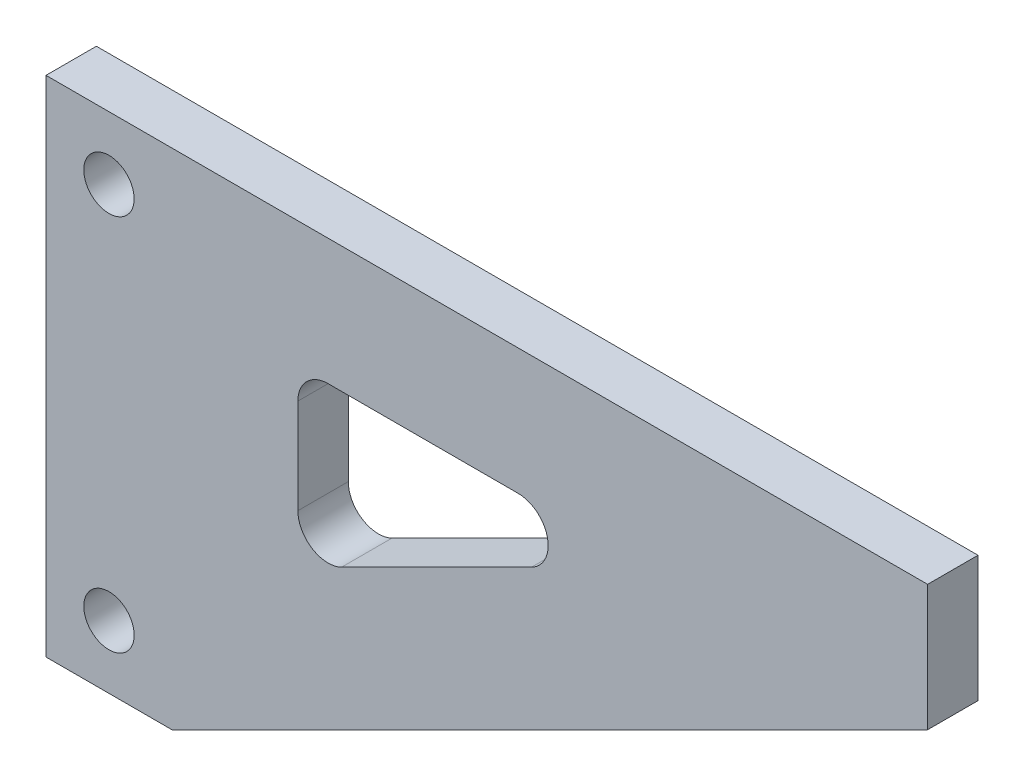
ISO-10303-21;
HEADER;
FILE_DESCRIPTION(('STEP AP214'),'2;1');
FILE_NAME('part.step','',(''),(''),'','','');
FILE_SCHEMA(('AUTOMOTIVE_DESIGN { 1 0 10303 214 1 1 1 1 }'));
ENDSEC;
DATA;
#1=APPLICATION_CONTEXT('core data for automotive mechanical design processes');
#2=APPLICATION_PROTOCOL_DEFINITION('international standard','automotive_design',2000,#1);
#3=PRODUCT_CONTEXT('',#1,'mechanical');
#4=PRODUCT('Part','Part','',(#3));
#5=PRODUCT_RELATED_PRODUCT_CATEGORY('part','',(#4));
#6=PRODUCT_DEFINITION_FORMATION('','',#4);
#7=PRODUCT_DEFINITION_CONTEXT('part definition',#1,'design');
#8=PRODUCT_DEFINITION('design','',#6,#7);
#9=PRODUCT_DEFINITION_SHAPE('','',#8);
#10=(LENGTH_UNIT() NAMED_UNIT(*) SI_UNIT(.MILLI.,.METRE.));
#11=(NAMED_UNIT(*) PLANE_ANGLE_UNIT() SI_UNIT($,.RADIAN.));
#12=(NAMED_UNIT(*) SI_UNIT($,.STERADIAN.) SOLID_ANGLE_UNIT());
#13=UNCERTAINTY_MEASURE_WITH_UNIT(LENGTH_MEASURE(1.E-05),#10,'distance_accuracy_value','');
#14=(GEOMETRIC_REPRESENTATION_CONTEXT(3) GLOBAL_UNCERTAINTY_ASSIGNED_CONTEXT((#13)) GLOBAL_UNIT_ASSIGNED_CONTEXT((#10,
#11,#12)) REPRESENTATION_CONTEXT('',''));
#15=CARTESIAN_POINT('',(0.,0.,0.));
#16=DIRECTION('',(0.,0.,1.));
#17=DIRECTION('',(1.,0.,0.));
#18=AXIS2_PLACEMENT_3D('',#15,#16,#17);
#19=CARTESIAN_POINT('',(0.,100.,10.));
#20=DIRECTION('',(0.,0.,-1.));
#21=DIRECTION('',(-1.,0.,0.));
#22=AXIS2_PLACEMENT_3D('',#19,#20,#21);
#23=PLANE('',#22);
#24=CARTESIAN_POINT('',(12.5,87.5,10.));
#25=DIRECTION('',(0.,0.,1.));
#26=DIRECTION('',(1.,0.,0.));
#27=AXIS2_PLACEMENT_3D('',#24,#25,#26);
#28=CIRCLE('',#27,5.);
#29=CARTESIAN_POINT('',(17.5,87.5,10.));
#30=VERTEX_POINT('',#29);
#31=EDGE_CURVE('E178',#30,#30,#28,.T.);
#32=ORIENTED_EDGE('',*,*,#31,.F.);
#33=EDGE_LOOP('',(#32));
#34=FACE_BOUND('',#33,.T.);
#35=DIRECTION('',(0.,1.,0.));
#36=VECTOR('',#35,1.);
#37=CARTESIAN_POINT('',(0.,0.,10.));
#38=LINE('',#37,#36);
#39=CARTESIAN_POINT('',(0.,0.,10.));
#40=VERTEX_POINT('',#39);
#41=CARTESIAN_POINT('',(0.,100.,10.));
#42=VERTEX_POINT('',#41);
#43=EDGE_CURVE('E202',#40,#42,#38,.T.);
#44=ORIENTED_EDGE('',*,*,#43,.F.);
#45=DIRECTION('',(1.,0.,0.));
#46=VECTOR('',#45,1.);
#47=CARTESIAN_POINT('',(0.,0.,10.));
#48=LINE('',#47,#46);
#49=CARTESIAN_POINT('',(25.,0.,10.));
#50=VERTEX_POINT('',#49);
#51=EDGE_CURVE('E214',#40,#50,#48,.T.);
#52=ORIENTED_EDGE('',*,*,#51,.T.);
#53=DIRECTION('',(-0.894427190999916,-0.447213595499958,0.));
#54=VECTOR('',#53,1.);
#55=CARTESIAN_POINT('',(175.,75.,10.));
#56=LINE('',#55,#54);
#57=CARTESIAN_POINT('',(175.,75.,10.));
#58=VERTEX_POINT('',#57);
#59=EDGE_CURVE('E211',#58,#50,#56,.T.);
#60=ORIENTED_EDGE('',*,*,#59,.F.);
#61=DIRECTION('',(0.,-1.,0.));
#62=VECTOR('',#61,1.);
#63=CARTESIAN_POINT('',(175.,100.,10.));
#64=LINE('',#63,#62);
#65=CARTESIAN_POINT('',(175.,100.,10.));
#66=VERTEX_POINT('',#65);
#67=EDGE_CURVE('E208',#66,#58,#64,.T.);
#68=ORIENTED_EDGE('',*,*,#67,.F.);
#69=DIRECTION('',(1.,0.,0.));
#70=VECTOR('',#69,1.);
#71=CARTESIAN_POINT('',(0.,100.,10.));
#72=LINE('',#71,#70);
#73=EDGE_CURVE('E205',#42,#66,#72,.T.);
#74=ORIENTED_EDGE('',*,*,#73,.F.);
#75=EDGE_LOOP('',(#44,#52,#60,#68,#74));
#76=FACE_BOUND('',#75,.T.);
#77=CARTESIAN_POINT('',(12.5,12.5,10.));
#78=DIRECTION('',(0.,0.,1.));
#79=DIRECTION('',(1.,0.,0.));
#80=AXIS2_PLACEMENT_3D('',#77,#78,#79);
#81=CIRCLE('',#80,5.);
#82=CARTESIAN_POINT('',(17.5,12.5,10.));
#83=VERTEX_POINT('',#82);
#84=EDGE_CURVE('E184',#83,#83,#81,.T.);
#85=ORIENTED_EDGE('',*,*,#84,.F.);
#86=EDGE_LOOP('',(#85));
#87=FACE_BOUND('',#86,.T.);
#88=CARTESIAN_POINT('',(93.6818926975065,69.,10.));
#89=DIRECTION('',(0.,0.,1.));
#90=DIRECTION('',(1.,0.,0.));
#91=AXIS2_PLACEMENT_3D('',#88,#89,#90);
#92=CIRCLE('',#91,6.00000000000001);
#93=CARTESIAN_POINT('',(96.3651742705062,63.6334368540005,10.));
#94=VERTEX_POINT('',#93);
#95=CARTESIAN_POINT('',(93.6818926975065,75.,10.));
#96=VERTEX_POINT('',#95);
#97=EDGE_CURVE('E127',#94,#96,#92,.T.);
#98=ORIENTED_EDGE('',*,*,#97,.F.);
#99=DIRECTION('',(-0.894427190999916,-0.447213595499958,0.));
#100=VECTOR('',#99,1.);
#101=CARTESIAN_POINT('',(96.3651742705062,63.6334368540005,10.));
#102=LINE('',#101,#100);
#103=CARTESIAN_POINT('',(58.6832815729997,44.7924905052472,10.));
#104=VERTEX_POINT('',#103);
#105=EDGE_CURVE('E165',#94,#104,#102,.T.);
#106=ORIENTED_EDGE('',*,*,#105,.T.);
#107=CARTESIAN_POINT('',(56.,50.1590536512467,10.));
#108=DIRECTION('',(0.,0.,1.));
#109=DIRECTION('',(1.,0.,0.));
#110=AXIS2_PLACEMENT_3D('',#107,#108,#109);
#111=CIRCLE('',#110,6.);
#112=CARTESIAN_POINT('',(50.,50.1590536512467,10.));
#113=VERTEX_POINT('',#112);
#114=EDGE_CURVE('E163',#113,#104,#111,.T.);
#115=ORIENTED_EDGE('',*,*,#114,.F.);
#116=DIRECTION('',(0.,1.,0.));
#117=VECTOR('',#116,1.);
#118=CARTESIAN_POINT('',(50.,50.1590536512467,10.));
#119=LINE('',#118,#117);
#120=CARTESIAN_POINT('',(50.,69.,10.));
#121=VERTEX_POINT('',#120);
#122=EDGE_CURVE('E160',#113,#121,#119,.T.);
#123=ORIENTED_EDGE('',*,*,#122,.T.);
#124=CARTESIAN_POINT('',(56.,69.,10.));
#125=DIRECTION('',(0.,0.,1.));
#126=DIRECTION('',(1.,0.,0.));
#127=AXIS2_PLACEMENT_3D('',#124,#125,#126);
#128=CIRCLE('',#127,6.);
#129=CARTESIAN_POINT('',(56.,75.,10.));
#130=VERTEX_POINT('',#129);
#131=EDGE_CURVE('E158',#130,#121,#128,.T.);
#132=ORIENTED_EDGE('',*,*,#131,.F.);
#133=DIRECTION('',(1.,0.,0.));
#134=VECTOR('',#133,1.);
#135=CARTESIAN_POINT('',(56.,75.,10.));
#136=LINE('',#135,#134);
#137=EDGE_CURVE('E156',#130,#96,#136,.T.);
#138=ORIENTED_EDGE('',*,*,#137,.T.);
#139=EDGE_LOOP('',(#98,#106,#115,#123,#132,#138));
#140=FACE_BOUND('',#139,.T.);
#141=ADVANCED_FACE('F40',(#34,#76,#87,#140),#23,.F.);
#142=CARTESIAN_POINT('',(0.,100.,0.));
#143=DIRECTION('',(0.,0.,-1.));
#144=DIRECTION('',(-1.,0.,0.));
#145=AXIS2_PLACEMENT_3D('',#142,#143,#144);
#146=PLANE('',#145);
#147=CARTESIAN_POINT('',(12.5,87.5,0.));
#148=DIRECTION('',(0.,0.,1.));
#149=DIRECTION('',(1.,0.,0.));
#150=AXIS2_PLACEMENT_3D('',#147,#148,#149);
#151=CIRCLE('',#150,5.);
#152=CARTESIAN_POINT('',(17.5,87.5,0.));
#153=VERTEX_POINT('',#152);
#154=EDGE_CURVE('E131',#153,#153,#151,.T.);
#155=ORIENTED_EDGE('',*,*,#154,.T.);
#156=EDGE_LOOP('',(#155));
#157=FACE_BOUND('',#156,.T.);
#158=DIRECTION('',(0.,1.,0.));
#159=VECTOR('',#158,1.);
#160=CARTESIAN_POINT('',(0.,0.,0.));
#161=LINE('',#160,#159);
#162=CARTESIAN_POINT('',(0.,0.,0.));
#163=VERTEX_POINT('',#162);
#164=CARTESIAN_POINT('',(0.,100.,0.));
#165=VERTEX_POINT('',#164);
#166=EDGE_CURVE('E187',#163,#165,#161,.T.);
#167=ORIENTED_EDGE('',*,*,#166,.T.);
#168=DIRECTION('',(1.,0.,0.));
#169=VECTOR('',#168,1.);
#170=CARTESIAN_POINT('',(0.,100.,0.));
#171=LINE('',#170,#169);
#172=CARTESIAN_POINT('',(175.,100.,0.));
#173=VERTEX_POINT('',#172);
#174=EDGE_CURVE('E190',#165,#173,#171,.T.);
#175=ORIENTED_EDGE('',*,*,#174,.T.);
#176=DIRECTION('',(0.,-1.,0.));
#177=VECTOR('',#176,1.);
#178=CARTESIAN_POINT('',(175.,100.,0.));
#179=LINE('',#178,#177);
#180=CARTESIAN_POINT('',(175.,75.,0.));
#181=VERTEX_POINT('',#180);
#182=EDGE_CURVE('E193',#173,#181,#179,.T.);
#183=ORIENTED_EDGE('',*,*,#182,.T.);
#184=DIRECTION('',(-0.894427190999916,-0.447213595499958,0.));
#185=VECTOR('',#184,1.);
#186=CARTESIAN_POINT('',(175.,75.,0.));
#187=LINE('',#186,#185);
#188=CARTESIAN_POINT('',(25.,0.,0.));
#189=VERTEX_POINT('',#188);
#190=EDGE_CURVE('E196',#181,#189,#187,.T.);
#191=ORIENTED_EDGE('',*,*,#190,.T.);
#192=DIRECTION('',(1.,0.,0.));
#193=VECTOR('',#192,1.);
#194=CARTESIAN_POINT('',(0.,0.,0.));
#195=LINE('',#194,#193);
#196=EDGE_CURVE('E199',#163,#189,#195,.T.);
#197=ORIENTED_EDGE('',*,*,#196,.F.);
#198=EDGE_LOOP('',(#167,#175,#183,#191,#197));
#199=FACE_BOUND('',#198,.T.);
#200=CARTESIAN_POINT('',(12.5,12.5,0.));
#201=DIRECTION('',(0.,0.,1.));
#202=DIRECTION('',(1.,0.,0.));
#203=AXIS2_PLACEMENT_3D('',#200,#201,#202);
#204=CIRCLE('',#203,5.);
#205=CARTESIAN_POINT('',(17.5,12.5,0.));
#206=VERTEX_POINT('',#205);
#207=EDGE_CURVE('E181',#206,#206,#204,.T.);
#208=ORIENTED_EDGE('',*,*,#207,.T.);
#209=EDGE_LOOP('',(#208));
#210=FACE_BOUND('',#209,.T.);
#211=DIRECTION('',(-0.894427190999916,-0.447213595499958,0.));
#212=VECTOR('',#211,1.);
#213=CARTESIAN_POINT('',(96.3651742705062,63.6334368540005,0.));
#214=LINE('',#213,#212);
#215=CARTESIAN_POINT('',(96.3651742705063,63.6334368540005,0.));
#216=VERTEX_POINT('',#215);
#217=CARTESIAN_POINT('',(58.6832815729997,44.7924905052472,0.));
#218=VERTEX_POINT('',#217);
#219=EDGE_CURVE('E145',#216,#218,#214,.T.);
#220=ORIENTED_EDGE('',*,*,#219,.F.);
#221=CARTESIAN_POINT('',(93.6818926975065,69.,0.));
#222=DIRECTION('',(0.,0.,1.));
#223=DIRECTION('',(1.,0.,0.));
#224=AXIS2_PLACEMENT_3D('',#221,#222,#223);
#225=CIRCLE('',#224,6.00000000000001);
#226=CARTESIAN_POINT('',(93.6818926975065,75.,0.));
#227=VERTEX_POINT('',#226);
#228=EDGE_CURVE('E65',#216,#227,#225,.T.);
#229=ORIENTED_EDGE('',*,*,#228,.T.);
#230=DIRECTION('',(1.,0.,0.));
#231=VECTOR('',#230,1.);
#232=CARTESIAN_POINT('',(56.,75.,0.));
#233=LINE('',#232,#231);
#234=CARTESIAN_POINT('',(56.,75.,0.));
#235=VERTEX_POINT('',#234);
#236=EDGE_CURVE('E135',#235,#227,#233,.T.);
#237=ORIENTED_EDGE('',*,*,#236,.F.);
#238=CARTESIAN_POINT('',(56.,69.,0.));
#239=DIRECTION('',(0.,0.,1.));
#240=DIRECTION('',(1.,0.,0.));
#241=AXIS2_PLACEMENT_3D('',#238,#239,#240);
#242=CIRCLE('',#241,6.);
#243=CARTESIAN_POINT('',(50.,69.,0.));
#244=VERTEX_POINT('',#243);
#245=EDGE_CURVE('E140',#235,#244,#242,.T.);
#246=ORIENTED_EDGE('',*,*,#245,.T.);
#247=DIRECTION('',(0.,1.,0.));
#248=VECTOR('',#247,1.);
#249=CARTESIAN_POINT('',(50.,50.1590536512467,0.));
#250=LINE('',#249,#248);
#251=CARTESIAN_POINT('',(50.,50.1590536512467,0.));
#252=VERTEX_POINT('',#251);
#253=EDGE_CURVE('E149',#252,#244,#250,.T.);
#254=ORIENTED_EDGE('',*,*,#253,.F.);
#255=CARTESIAN_POINT('',(56.,50.1590536512467,0.));
#256=DIRECTION('',(0.,0.,1.));
#257=DIRECTION('',(1.,0.,0.));
#258=AXIS2_PLACEMENT_3D('',#255,#256,#257);
#259=CIRCLE('',#258,6.);
#260=EDGE_CURVE('E152',#252,#218,#259,.T.);
#261=ORIENTED_EDGE('',*,*,#260,.T.);
#262=EDGE_LOOP('',(#220,#229,#237,#246,#254,#261));
#263=FACE_BOUND('',#262,.T.);
#264=ADVANCED_FACE('F143',(#157,#199,#210,#263),#146,.T.);
#265=CARTESIAN_POINT('',(0.,0.,10.));
#266=DIRECTION('',(-1.,0.,0.));
#267=DIRECTION('',(0.,0.,1.));
#268=AXIS2_PLACEMENT_3D('',#265,#266,#267);
#269=PLANE('',#268);
#270=ORIENTED_EDGE('',*,*,#166,.F.);
#271=DIRECTION('',(0.,0.,-1.));
#272=VECTOR('',#271,1.);
#273=CARTESIAN_POINT('',(0.,0.,10.));
#274=LINE('',#273,#272);
#275=EDGE_CURVE('E11',#40,#163,#274,.T.);
#276=ORIENTED_EDGE('',*,*,#275,.F.);
#277=ORIENTED_EDGE('',*,*,#43,.T.);
#278=DIRECTION('',(0.,0.,-1.));
#279=VECTOR('',#278,1.);
#280=CARTESIAN_POINT('',(0.,100.,10.));
#281=LINE('',#280,#279);
#282=EDGE_CURVE('E44',#42,#165,#281,.T.);
#283=ORIENTED_EDGE('',*,*,#282,.T.);
#284=EDGE_LOOP('',(#270,#276,#277,#283));
#285=FACE_BOUND('',#284,.T.);
#286=ADVANCED_FACE('F42',(#285),#269,.T.);
#287=CARTESIAN_POINT('',(0.,0.,10.));
#288=DIRECTION('',(0.,1.,0.));
#289=DIRECTION('',(0.,0.,1.));
#290=AXIS2_PLACEMENT_3D('',#287,#288,#289);
#291=PLANE('',#290);
#292=ORIENTED_EDGE('',*,*,#196,.T.);
#293=DIRECTION('',(0.,0.,-1.));
#294=VECTOR('',#293,1.);
#295=CARTESIAN_POINT('',(25.,0.,10.));
#296=LINE('',#295,#294);
#297=EDGE_CURVE('E49',#50,#189,#296,.T.);
#298=ORIENTED_EDGE('',*,*,#297,.F.);
#299=ORIENTED_EDGE('',*,*,#51,.F.);
#300=ORIENTED_EDGE('',*,*,#275,.T.);
#301=EDGE_LOOP('',(#292,#298,#299,#300));
#302=FACE_BOUND('',#301,.T.);
#303=ADVANCED_FACE('F233',(#302),#291,.F.);
#304=CARTESIAN_POINT('',(175.,75.,10.));
#305=DIRECTION('',(0.447213595499958,-0.894427190999916,0.));
#306=DIRECTION('',(0.894427190999916,0.447213595499958,0.));
#307=AXIS2_PLACEMENT_3D('',#304,#305,#306);
#308=PLANE('',#307);
#309=ORIENTED_EDGE('',*,*,#190,.F.);
#310=DIRECTION('',(0.,0.,-1.));
#311=VECTOR('',#310,1.);
#312=CARTESIAN_POINT('',(175.,75.,10.));
#313=LINE('',#312,#311);
#314=EDGE_CURVE('E217',#58,#181,#313,.T.);
#315=ORIENTED_EDGE('',*,*,#314,.F.);
#316=ORIENTED_EDGE('',*,*,#59,.T.);
#317=ORIENTED_EDGE('',*,*,#297,.T.);
#318=EDGE_LOOP('',(#309,#315,#316,#317));
#319=FACE_BOUND('',#318,.T.);
#320=ADVANCED_FACE('F242',(#319),#308,.T.);
#321=CARTESIAN_POINT('',(175.,100.,10.));
#322=DIRECTION('',(1.,0.,0.));
#323=DIRECTION('',(0.,1.,0.));
#324=AXIS2_PLACEMENT_3D('',#321,#322,#323);
#325=PLANE('',#324);
#326=ORIENTED_EDGE('',*,*,#182,.F.);
#327=DIRECTION('',(0.,0.,-1.));
#328=VECTOR('',#327,1.);
#329=CARTESIAN_POINT('',(175.,100.,10.));
#330=LINE('',#329,#328);
#331=EDGE_CURVE('E218',#66,#173,#330,.T.);
#332=ORIENTED_EDGE('',*,*,#331,.F.);
#333=ORIENTED_EDGE('',*,*,#67,.T.);
#334=ORIENTED_EDGE('',*,*,#314,.T.);
#335=EDGE_LOOP('',(#326,#332,#333,#334));
#336=FACE_BOUND('',#335,.T.);
#337=ADVANCED_FACE('F240',(#336),#325,.T.);
#338=CARTESIAN_POINT('',(0.,100.,10.));
#339=DIRECTION('',(0.,1.,0.));
#340=DIRECTION('',(0.,0.,1.));
#341=AXIS2_PLACEMENT_3D('',#338,#339,#340);
#342=PLANE('',#341);
#343=ORIENTED_EDGE('',*,*,#174,.F.);
#344=ORIENTED_EDGE('',*,*,#282,.F.);
#345=ORIENTED_EDGE('',*,*,#73,.T.);
#346=ORIENTED_EDGE('',*,*,#331,.T.);
#347=EDGE_LOOP('',(#343,#344,#345,#346));
#348=FACE_BOUND('',#347,.T.);
#349=ADVANCED_FACE('F226',(#348),#342,.T.);
#350=CARTESIAN_POINT('',(12.5,12.5,10.));
#351=DIRECTION('',(0.,0.,-1.));
#352=DIRECTION('',(-1.,0.,0.));
#353=AXIS2_PLACEMENT_3D('',#350,#351,#352);
#354=CYLINDRICAL_SURFACE('',#353,5.);
#355=ORIENTED_EDGE('',*,*,#84,.T.);
#356=EDGE_LOOP('',(#355));
#357=FACE_BOUND('',#356,.T.);
#358=ORIENTED_EDGE('',*,*,#207,.F.);
#359=EDGE_LOOP('',(#358));
#360=FACE_BOUND('',#359,.T.);
#361=ADVANCED_FACE('F261',(#357,#360),#354,.F.);
#362=CARTESIAN_POINT('',(12.5,87.5,10.));
#363=DIRECTION('',(0.,0.,-1.));
#364=DIRECTION('',(-1.,0.,0.));
#365=AXIS2_PLACEMENT_3D('',#362,#363,#364);
#366=CYLINDRICAL_SURFACE('',#365,5.);
#367=ORIENTED_EDGE('',*,*,#31,.T.);
#368=EDGE_LOOP('',(#367));
#369=FACE_BOUND('',#368,.T.);
#370=ORIENTED_EDGE('',*,*,#154,.F.);
#371=EDGE_LOOP('',(#370));
#372=FACE_BOUND('',#371,.T.);
#373=ADVANCED_FACE('F264',(#369,#372),#366,.F.);
#374=CARTESIAN_POINT('',(93.6818926975065,69.,10.));
#375=DIRECTION('',(0.,0.,-1.));
#376=DIRECTION('',(-1.,0.,0.));
#377=AXIS2_PLACEMENT_3D('',#374,#375,#376);
#378=CYLINDRICAL_SURFACE('',#377,6.00000000000001);
#379=ORIENTED_EDGE('',*,*,#228,.F.);
#380=DIRECTION('',(0.,0.,-1.));
#381=VECTOR('',#380,1.);
#382=CARTESIAN_POINT('',(96.3651742705062,63.6334368540005,10.));
#383=LINE('',#382,#381);
#384=EDGE_CURVE('E168',#94,#216,#383,.T.);
#385=ORIENTED_EDGE('',*,*,#384,.F.);
#386=ORIENTED_EDGE('',*,*,#97,.T.);
#387=DIRECTION('',(0.,0.,-1.));
#388=VECTOR('',#387,1.);
#389=CARTESIAN_POINT('',(93.6818926975065,75.,10.));
#390=LINE('',#389,#388);
#391=EDGE_CURVE('E123',#96,#227,#390,.T.);
#392=ORIENTED_EDGE('',*,*,#391,.T.);
#393=EDGE_LOOP('',(#379,#385,#386,#392));
#394=FACE_BOUND('',#393,.T.);
#395=ADVANCED_FACE('F125',(#394),#378,.F.);
#396=CARTESIAN_POINT('',(56.,75.,10.));
#397=DIRECTION('',(0.,1.,0.));
#398=DIRECTION('',(0.,0.,1.));
#399=AXIS2_PLACEMENT_3D('',#396,#397,#398);
#400=PLANE('',#399);
#401=ORIENTED_EDGE('',*,*,#236,.T.);
#402=ORIENTED_EDGE('',*,*,#391,.F.);
#403=ORIENTED_EDGE('',*,*,#137,.F.);
#404=DIRECTION('',(0.,0.,-1.));
#405=VECTOR('',#404,1.);
#406=CARTESIAN_POINT('',(56.,75.,10.));
#407=LINE('',#406,#405);
#408=EDGE_CURVE('E132',#130,#235,#407,.T.);
#409=ORIENTED_EDGE('',*,*,#408,.T.);
#410=EDGE_LOOP('',(#401,#402,#403,#409));
#411=FACE_BOUND('',#410,.T.);
#412=ADVANCED_FACE('F136',(#411),#400,.F.);
#413=CARTESIAN_POINT('',(56.,69.,10.));
#414=DIRECTION('',(0.,0.,-1.));
#415=DIRECTION('',(-1.,0.,0.));
#416=AXIS2_PLACEMENT_3D('',#413,#414,#415);
#417=CYLINDRICAL_SURFACE('',#416,6.);
#418=ORIENTED_EDGE('',*,*,#245,.F.);
#419=ORIENTED_EDGE('',*,*,#408,.F.);
#420=ORIENTED_EDGE('',*,*,#131,.T.);
#421=DIRECTION('',(0.,0.,-1.));
#422=VECTOR('',#421,1.);
#423=CARTESIAN_POINT('',(50.,69.,10.));
#424=LINE('',#423,#422);
#425=EDGE_CURVE('E173',#121,#244,#424,.T.);
#426=ORIENTED_EDGE('',*,*,#425,.T.);
#427=EDGE_LOOP('',(#418,#419,#420,#426));
#428=FACE_BOUND('',#427,.T.);
#429=ADVANCED_FACE('F273',(#428),#417,.F.);
#430=CARTESIAN_POINT('',(50.,50.1590536512467,10.));
#431=DIRECTION('',(-1.,0.,0.));
#432=DIRECTION('',(0.,-1.,0.));
#433=AXIS2_PLACEMENT_3D('',#430,#431,#432);
#434=PLANE('',#433);
#435=ORIENTED_EDGE('',*,*,#253,.T.);
#436=ORIENTED_EDGE('',*,*,#425,.F.);
#437=ORIENTED_EDGE('',*,*,#122,.F.);
#438=DIRECTION('',(0.,0.,-1.));
#439=VECTOR('',#438,1.);
#440=CARTESIAN_POINT('',(50.,50.1590536512467,10.));
#441=LINE('',#440,#439);
#442=EDGE_CURVE('E171',#113,#252,#441,.T.);
#443=ORIENTED_EDGE('',*,*,#442,.T.);
#444=EDGE_LOOP('',(#435,#436,#437,#443));
#445=FACE_BOUND('',#444,.T.);
#446=ADVANCED_FACE('F276',(#445),#434,.F.);
#447=CARTESIAN_POINT('',(56.,50.1590536512467,10.));
#448=DIRECTION('',(0.,0.,-1.));
#449=DIRECTION('',(-1.,0.,0.));
#450=AXIS2_PLACEMENT_3D('',#447,#448,#449);
#451=CYLINDRICAL_SURFACE('',#450,6.);
#452=ORIENTED_EDGE('',*,*,#260,.F.);
#453=ORIENTED_EDGE('',*,*,#442,.F.);
#454=ORIENTED_EDGE('',*,*,#114,.T.);
#455=DIRECTION('',(0.,0.,-1.));
#456=VECTOR('',#455,1.);
#457=CARTESIAN_POINT('',(58.6832815729997,44.7924905052472,10.));
#458=LINE('',#457,#456);
#459=EDGE_CURVE('E57',#104,#218,#458,.T.);
#460=ORIENTED_EDGE('',*,*,#459,.T.);
#461=EDGE_LOOP('',(#452,#453,#454,#460));
#462=FACE_BOUND('',#461,.T.);
#463=ADVANCED_FACE('F280',(#462),#451,.F.);
#464=CARTESIAN_POINT('',(96.3651742705062,63.6334368540005,10.));
#465=DIRECTION('',(0.447213595499958,-0.894427190999916,0.));
#466=DIRECTION('',(0.894427190999916,0.447213595499958,0.));
#467=AXIS2_PLACEMENT_3D('',#464,#465,#466);
#468=PLANE('',#467);
#469=ORIENTED_EDGE('',*,*,#219,.T.);
#470=ORIENTED_EDGE('',*,*,#459,.F.);
#471=ORIENTED_EDGE('',*,*,#105,.F.);
#472=ORIENTED_EDGE('',*,*,#384,.T.);
#473=EDGE_LOOP('',(#469,#470,#471,#472));
#474=FACE_BOUND('',#473,.T.);
#475=ADVANCED_FACE('F284',(#474),#468,.F.);
#476=CLOSED_SHELL('',(#141,#264,#286,#303,#320,#337,#349,#361,#373,#395,#412,#429,#446,#463,#475));
#477=MANIFOLD_SOLID_BREP('B2',#476);
#478=ADVANCED_BREP_SHAPE_REPRESENTATION('',(#18,#477),#14);
#479=SHAPE_DEFINITION_REPRESENTATION(#9,#478);
ENDSEC;
END-ISO-10303-21;
